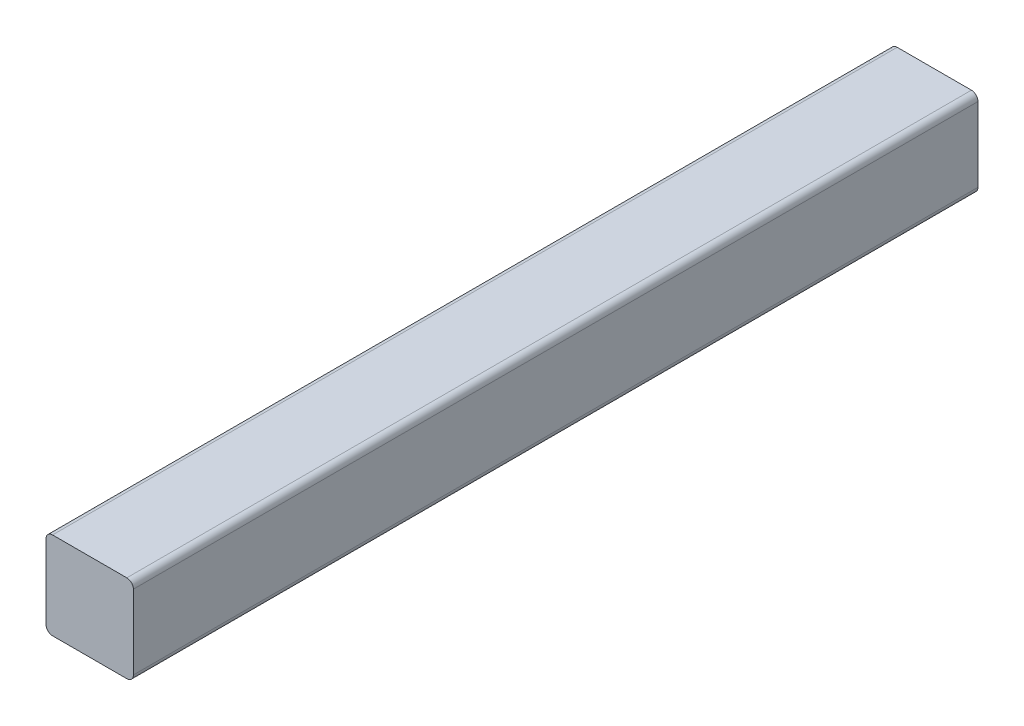
ISO-10303-21;
HEADER;
FILE_DESCRIPTION(('STEP AP214'),'2;1');
FILE_NAME('part.step','',(''),(''),'','','');
FILE_SCHEMA(('AUTOMOTIVE_DESIGN { 1 0 10303 214 1 1 1 1 }'));
ENDSEC;
DATA;
#1=APPLICATION_CONTEXT('core data for automotive mechanical design processes');
#2=APPLICATION_PROTOCOL_DEFINITION('international standard','automotive_design',2000,#1);
#3=PRODUCT_CONTEXT('',#1,'mechanical');
#4=PRODUCT('Part','Part','',(#3));
#5=PRODUCT_RELATED_PRODUCT_CATEGORY('part','',(#4));
#6=PRODUCT_DEFINITION_FORMATION('','',#4);
#7=PRODUCT_DEFINITION_CONTEXT('part definition',#1,'design');
#8=PRODUCT_DEFINITION('design','',#6,#7);
#9=PRODUCT_DEFINITION_SHAPE('','',#8);
#10=(LENGTH_UNIT() NAMED_UNIT(*) SI_UNIT(.MILLI.,.METRE.));
#11=(NAMED_UNIT(*) PLANE_ANGLE_UNIT() SI_UNIT($,.RADIAN.));
#12=(NAMED_UNIT(*) SI_UNIT($,.STERADIAN.) SOLID_ANGLE_UNIT());
#13=UNCERTAINTY_MEASURE_WITH_UNIT(LENGTH_MEASURE(1.E-05),#10,'distance_accuracy_value','');
#14=(GEOMETRIC_REPRESENTATION_CONTEXT(3) GLOBAL_UNCERTAINTY_ASSIGNED_CONTEXT((#13)) GLOBAL_UNIT_ASSIGNED_CONTEXT((#10,
#11,#12)) REPRESENTATION_CONTEXT('',''));
#15=CARTESIAN_POINT('',(0.,0.,0.));
#16=DIRECTION('',(0.,0.,1.));
#17=DIRECTION('',(1.,0.,0.));
#18=AXIS2_PLACEMENT_3D('',#15,#16,#17);
#19=CARTESIAN_POINT('',(12.75,12.75,290.));
#20=DIRECTION('',(0.,0.,-1.));
#21=DIRECTION('',(-1.,0.,0.));
#22=AXIS2_PLACEMENT_3D('',#19,#20,#21);
#23=CYLINDRICAL_SURFACE('',#22,2.25);
#24=CARTESIAN_POINT('',(12.75,12.75,0.));
#25=DIRECTION('',(0.,0.,1.));
#26=DIRECTION('',(-1.,0.,0.));
#27=AXIS2_PLACEMENT_3D('',#24,#25,#26);
#28=CIRCLE('',#27,2.25);
#29=CARTESIAN_POINT('',(15.,12.75,0.));
#30=VERTEX_POINT('',#29);
#31=CARTESIAN_POINT('',(12.75,15.,0.));
#32=VERTEX_POINT('',#31);
#33=EDGE_CURVE('E101',#30,#32,#28,.T.);
#34=ORIENTED_EDGE('',*,*,#33,.T.);
#35=DIRECTION('',(0.,0.,-1.));
#36=VECTOR('',#35,1.);
#37=CARTESIAN_POINT('',(12.75,15.,290.));
#38=LINE('',#37,#36);
#39=CARTESIAN_POINT('',(12.75,15.,290.));
#40=VERTEX_POINT('',#39);
#41=EDGE_CURVE('E11',#40,#32,#38,.T.);
#42=ORIENTED_EDGE('',*,*,#41,.F.);
#43=CARTESIAN_POINT('',(12.75,12.75,290.));
#44=DIRECTION('',(0.,0.,1.));
#45=DIRECTION('',(-1.,0.,0.));
#46=AXIS2_PLACEMENT_3D('',#43,#44,#45);
#47=CIRCLE('',#46,2.25);
#48=CARTESIAN_POINT('',(15.,12.75,290.));
#49=VERTEX_POINT('',#48);
#50=EDGE_CURVE('E128',#49,#40,#47,.T.);
#51=ORIENTED_EDGE('',*,*,#50,.F.);
#52=DIRECTION('',(0.,0.,-1.));
#53=VECTOR('',#52,1.);
#54=CARTESIAN_POINT('',(15.,12.75,290.));
#55=LINE('',#54,#53);
#56=EDGE_CURVE('E114',#49,#30,#55,.T.);
#57=ORIENTED_EDGE('',*,*,#56,.T.);
#58=EDGE_LOOP('',(#34,#42,#51,#57));
#59=FACE_BOUND('',#58,.T.);
#60=ADVANCED_FACE('F33',(#59),#23,.T.);
#61=CARTESIAN_POINT('',(-12.75,15.,290.));
#62=DIRECTION('',(0.,-1.,0.));
#63=DIRECTION('',(0.,0.,-1.));
#64=AXIS2_PLACEMENT_3D('',#61,#62,#63);
#65=PLANE('',#64);
#66=DIRECTION('',(-1.,0.,0.));
#67=VECTOR('',#66,1.);
#68=CARTESIAN_POINT('',(-12.75,15.,0.));
#69=LINE('',#68,#67);
#70=CARTESIAN_POINT('',(-12.75,15.,0.));
#71=VERTEX_POINT('',#70);
#72=EDGE_CURVE('E97',#32,#71,#69,.T.);
#73=ORIENTED_EDGE('',*,*,#72,.T.);
#74=DIRECTION('',(0.,0.,-1.));
#75=VECTOR('',#74,1.);
#76=CARTESIAN_POINT('',(-12.75,15.,290.));
#77=LINE('',#76,#75);
#78=CARTESIAN_POINT('',(-12.75,15.,290.));
#79=VERTEX_POINT('',#78);
#80=EDGE_CURVE('E40',#79,#71,#77,.T.);
#81=ORIENTED_EDGE('',*,*,#80,.F.);
#82=DIRECTION('',(-1.,0.,0.));
#83=VECTOR('',#82,1.);
#84=CARTESIAN_POINT('',(-12.75,15.,290.));
#85=LINE('',#84,#83);
#86=EDGE_CURVE('E110',#40,#79,#85,.T.);
#87=ORIENTED_EDGE('',*,*,#86,.F.);
#88=ORIENTED_EDGE('',*,*,#41,.T.);
#89=EDGE_LOOP('',(#73,#81,#87,#88));
#90=FACE_BOUND('',#89,.T.);
#91=ADVANCED_FACE('F109',(#90),#65,.F.);
#92=CARTESIAN_POINT('',(-12.75,12.75,290.));
#93=DIRECTION('',(0.,0.,-1.));
#94=DIRECTION('',(-1.,0.,0.));
#95=AXIS2_PLACEMENT_3D('',#92,#93,#94);
#96=CYLINDRICAL_SURFACE('',#95,2.25);
#97=CARTESIAN_POINT('',(-12.75,12.75,0.));
#98=DIRECTION('',(0.,0.,1.));
#99=DIRECTION('',(1.,0.,0.));
#100=AXIS2_PLACEMENT_3D('',#97,#98,#99);
#101=CIRCLE('',#100,2.25);
#102=CARTESIAN_POINT('',(-15.,12.75,0.));
#103=VERTEX_POINT('',#102);
#104=EDGE_CURVE('E103',#71,#103,#101,.T.);
#105=ORIENTED_EDGE('',*,*,#104,.T.);
#106=DIRECTION('',(0.,0.,-1.));
#107=VECTOR('',#106,1.);
#108=CARTESIAN_POINT('',(-15.,12.75,290.));
#109=LINE('',#108,#107);
#110=CARTESIAN_POINT('',(-15.,12.75,290.));
#111=VERTEX_POINT('',#110);
#112=EDGE_CURVE('E154',#111,#103,#109,.T.);
#113=ORIENTED_EDGE('',*,*,#112,.F.);
#114=CARTESIAN_POINT('',(-12.75,12.75,290.));
#115=DIRECTION('',(0.,0.,1.));
#116=DIRECTION('',(1.,0.,0.));
#117=AXIS2_PLACEMENT_3D('',#114,#115,#116);
#118=CIRCLE('',#117,2.25);
#119=EDGE_CURVE('E131',#79,#111,#118,.T.);
#120=ORIENTED_EDGE('',*,*,#119,.F.);
#121=ORIENTED_EDGE('',*,*,#80,.T.);
#122=EDGE_LOOP('',(#105,#113,#120,#121));
#123=FACE_BOUND('',#122,.T.);
#124=ADVANCED_FACE('F158',(#123),#96,.T.);
#125=CARTESIAN_POINT('',(-15.,12.75,290.));
#126=DIRECTION('',(1.,0.,0.));
#127=DIRECTION('',(0.,0.,-1.));
#128=AXIS2_PLACEMENT_3D('',#125,#126,#127);
#129=PLANE('',#128);
#130=DIRECTION('',(0.,-1.,0.));
#131=VECTOR('',#130,1.);
#132=CARTESIAN_POINT('',(-15.,12.75,0.));
#133=LINE('',#132,#131);
#134=CARTESIAN_POINT('',(-15.,-12.75,0.));
#135=VERTEX_POINT('',#134);
#136=EDGE_CURVE('E118',#103,#135,#133,.T.);
#137=ORIENTED_EDGE('',*,*,#136,.T.);
#138=DIRECTION('',(0.,0.,-1.));
#139=VECTOR('',#138,1.);
#140=CARTESIAN_POINT('',(-15.,-12.75,290.));
#141=LINE('',#140,#139);
#142=CARTESIAN_POINT('',(-15.,-12.75,290.));
#143=VERTEX_POINT('',#142);
#144=EDGE_CURVE('E151',#143,#135,#141,.T.);
#145=ORIENTED_EDGE('',*,*,#144,.F.);
#146=DIRECTION('',(0.,-1.,0.));
#147=VECTOR('',#146,1.);
#148=CARTESIAN_POINT('',(-15.,12.75,290.));
#149=LINE('',#148,#147);
#150=EDGE_CURVE('E133',#111,#143,#149,.T.);
#151=ORIENTED_EDGE('',*,*,#150,.F.);
#152=ORIENTED_EDGE('',*,*,#112,.T.);
#153=EDGE_LOOP('',(#137,#145,#151,#152));
#154=FACE_BOUND('',#153,.T.);
#155=ADVANCED_FACE('F166',(#154),#129,.F.);
#156=CARTESIAN_POINT('',(-12.75,-12.75,290.));
#157=DIRECTION('',(0.,0.,-1.));
#158=DIRECTION('',(-1.,0.,0.));
#159=AXIS2_PLACEMENT_3D('',#156,#157,#158);
#160=CYLINDRICAL_SURFACE('',#159,2.25);
#161=CARTESIAN_POINT('',(-12.75,-12.75,0.));
#162=DIRECTION('',(0.,0.,1.));
#163=DIRECTION('',(-1.,0.,0.));
#164=AXIS2_PLACEMENT_3D('',#161,#162,#163);
#165=CIRCLE('',#164,2.25);
#166=CARTESIAN_POINT('',(-12.75,-15.,0.));
#167=VERTEX_POINT('',#166);
#168=EDGE_CURVE('E120',#135,#167,#165,.T.);
#169=ORIENTED_EDGE('',*,*,#168,.T.);
#170=DIRECTION('',(0.,0.,-1.));
#171=VECTOR('',#170,1.);
#172=CARTESIAN_POINT('',(-12.75,-15.,290.));
#173=LINE('',#172,#171);
#174=CARTESIAN_POINT('',(-12.75,-15.,290.));
#175=VERTEX_POINT('',#174);
#176=EDGE_CURVE('E148',#175,#167,#173,.T.);
#177=ORIENTED_EDGE('',*,*,#176,.F.);
#178=CARTESIAN_POINT('',(-12.75,-12.75,290.));
#179=DIRECTION('',(0.,0.,1.));
#180=DIRECTION('',(-1.,0.,0.));
#181=AXIS2_PLACEMENT_3D('',#178,#179,#180);
#182=CIRCLE('',#181,2.25);
#183=EDGE_CURVE('E135',#143,#175,#182,.T.);
#184=ORIENTED_EDGE('',*,*,#183,.F.);
#185=ORIENTED_EDGE('',*,*,#144,.T.);
#186=EDGE_LOOP('',(#169,#177,#184,#185));
#187=FACE_BOUND('',#186,.T.);
#188=ADVANCED_FACE('F169',(#187),#160,.T.);
#189=CARTESIAN_POINT('',(-12.75,-15.,290.));
#190=DIRECTION('',(0.,1.,0.));
#191=DIRECTION('',(0.,0.,1.));
#192=AXIS2_PLACEMENT_3D('',#189,#190,#191);
#193=PLANE('',#192);
#194=DIRECTION('',(1.,0.,0.));
#195=VECTOR('',#194,1.);
#196=CARTESIAN_POINT('',(-12.75,-15.,0.));
#197=LINE('',#196,#195);
#198=CARTESIAN_POINT('',(12.75,-15.,0.));
#199=VERTEX_POINT('',#198);
#200=EDGE_CURVE('E122',#167,#199,#197,.T.);
#201=ORIENTED_EDGE('',*,*,#200,.T.);
#202=DIRECTION('',(0.,0.,-1.));
#203=VECTOR('',#202,1.);
#204=CARTESIAN_POINT('',(12.75,-15.,290.));
#205=LINE('',#204,#203);
#206=CARTESIAN_POINT('',(12.75,-15.,290.));
#207=VERTEX_POINT('',#206);
#208=EDGE_CURVE('E145',#207,#199,#205,.T.);
#209=ORIENTED_EDGE('',*,*,#208,.F.);
#210=DIRECTION('',(1.,0.,0.));
#211=VECTOR('',#210,1.);
#212=CARTESIAN_POINT('',(-12.75,-15.,290.));
#213=LINE('',#212,#211);
#214=EDGE_CURVE('E137',#175,#207,#213,.T.);
#215=ORIENTED_EDGE('',*,*,#214,.F.);
#216=ORIENTED_EDGE('',*,*,#176,.T.);
#217=EDGE_LOOP('',(#201,#209,#215,#216));
#218=FACE_BOUND('',#217,.T.);
#219=ADVANCED_FACE('F174',(#218),#193,.F.);
#220=CARTESIAN_POINT('',(12.75,-12.75,290.));
#221=DIRECTION('',(0.,0.,-1.));
#222=DIRECTION('',(-1.,0.,0.));
#223=AXIS2_PLACEMENT_3D('',#220,#221,#222);
#224=CYLINDRICAL_SURFACE('',#223,2.25);
#225=CARTESIAN_POINT('',(12.75,-12.75,0.));
#226=DIRECTION('',(0.,0.,1.));
#227=DIRECTION('',(1.,0.,0.));
#228=AXIS2_PLACEMENT_3D('',#225,#226,#227);
#229=CIRCLE('',#228,2.25);
#230=CARTESIAN_POINT('',(15.,-12.75,0.));
#231=VERTEX_POINT('',#230);
#232=EDGE_CURVE('E124',#199,#231,#229,.T.);
#233=ORIENTED_EDGE('',*,*,#232,.T.);
#234=DIRECTION('',(0.,0.,-1.));
#235=VECTOR('',#234,1.);
#236=CARTESIAN_POINT('',(15.,-12.75,290.));
#237=LINE('',#236,#235);
#238=CARTESIAN_POINT('',(15.,-12.75,290.));
#239=VERTEX_POINT('',#238);
#240=EDGE_CURVE('E142',#239,#231,#237,.T.);
#241=ORIENTED_EDGE('',*,*,#240,.F.);
#242=CARTESIAN_POINT('',(12.75,-12.75,290.));
#243=DIRECTION('',(0.,0.,1.));
#244=DIRECTION('',(1.,0.,0.));
#245=AXIS2_PLACEMENT_3D('',#242,#243,#244);
#246=CIRCLE('',#245,2.25);
#247=EDGE_CURVE('E52',#207,#239,#246,.T.);
#248=ORIENTED_EDGE('',*,*,#247,.F.);
#249=ORIENTED_EDGE('',*,*,#208,.T.);
#250=EDGE_LOOP('',(#233,#241,#248,#249));
#251=FACE_BOUND('',#250,.T.);
#252=ADVANCED_FACE('F177',(#251),#224,.T.);
#253=CARTESIAN_POINT('',(15.,12.75,290.));
#254=DIRECTION('',(-1.,0.,0.));
#255=DIRECTION('',(0.,0.,1.));
#256=AXIS2_PLACEMENT_3D('',#253,#254,#255);
#257=PLANE('',#256);
#258=DIRECTION('',(0.,1.,0.));
#259=VECTOR('',#258,1.);
#260=CARTESIAN_POINT('',(15.,12.75,0.));
#261=LINE('',#260,#259);
#262=EDGE_CURVE('E126',#231,#30,#261,.T.);
#263=ORIENTED_EDGE('',*,*,#262,.T.);
#264=ORIENTED_EDGE('',*,*,#56,.F.);
#265=DIRECTION('',(0.,1.,0.));
#266=VECTOR('',#265,1.);
#267=CARTESIAN_POINT('',(15.,12.75,290.));
#268=LINE('',#267,#266);
#269=EDGE_CURVE('E47',#239,#49,#268,.T.);
#270=ORIENTED_EDGE('',*,*,#269,.F.);
#271=ORIENTED_EDGE('',*,*,#240,.T.);
#272=EDGE_LOOP('',(#263,#264,#270,#271));
#273=FACE_BOUND('',#272,.T.);
#274=ADVANCED_FACE('F179',(#273),#257,.F.);
#275=CARTESIAN_POINT('',(12.75,12.75,290.));
#276=DIRECTION('',(0.,0.,-1.));
#277=DIRECTION('',(-1.,0.,0.));
#278=AXIS2_PLACEMENT_3D('',#275,#276,#277);
#279=PLANE('',#278);
#280=ORIENTED_EDGE('',*,*,#50,.T.);
#281=ORIENTED_EDGE('',*,*,#86,.T.);
#282=ORIENTED_EDGE('',*,*,#119,.T.);
#283=ORIENTED_EDGE('',*,*,#150,.T.);
#284=ORIENTED_EDGE('',*,*,#183,.T.);
#285=ORIENTED_EDGE('',*,*,#214,.T.);
#286=ORIENTED_EDGE('',*,*,#247,.T.);
#287=ORIENTED_EDGE('',*,*,#269,.T.);
#288=EDGE_LOOP('',(#280,#281,#282,#283,#284,#285,#286,#287));
#289=FACE_BOUND('',#288,.T.);
#290=ADVANCED_FACE('F161',(#289),#279,.F.);
#291=CARTESIAN_POINT('',(12.75,12.75,0.));
#292=DIRECTION('',(0.,0.,-1.));
#293=DIRECTION('',(-1.,0.,0.));
#294=AXIS2_PLACEMENT_3D('',#291,#292,#293);
#295=PLANE('',#294);
#296=ORIENTED_EDGE('',*,*,#33,.F.);
#297=ORIENTED_EDGE('',*,*,#262,.F.);
#298=ORIENTED_EDGE('',*,*,#232,.F.);
#299=ORIENTED_EDGE('',*,*,#200,.F.);
#300=ORIENTED_EDGE('',*,*,#168,.F.);
#301=ORIENTED_EDGE('',*,*,#136,.F.);
#302=ORIENTED_EDGE('',*,*,#104,.F.);
#303=ORIENTED_EDGE('',*,*,#72,.F.);
#304=EDGE_LOOP('',(#296,#297,#298,#299,#300,#301,#302,#303));
#305=FACE_BOUND('',#304,.T.);
#306=ADVANCED_FACE('F98',(#305),#295,.T.);
#307=CLOSED_SHELL('',(#60,#91,#124,#155,#188,#219,#252,#274,#290,#306));
#308=MANIFOLD_SOLID_BREP('B2',#307);
#309=ADVANCED_BREP_SHAPE_REPRESENTATION('',(#18,#308),#14);
#310=SHAPE_DEFINITION_REPRESENTATION(#9,#309);
ENDSEC;
END-ISO-10303-21;
